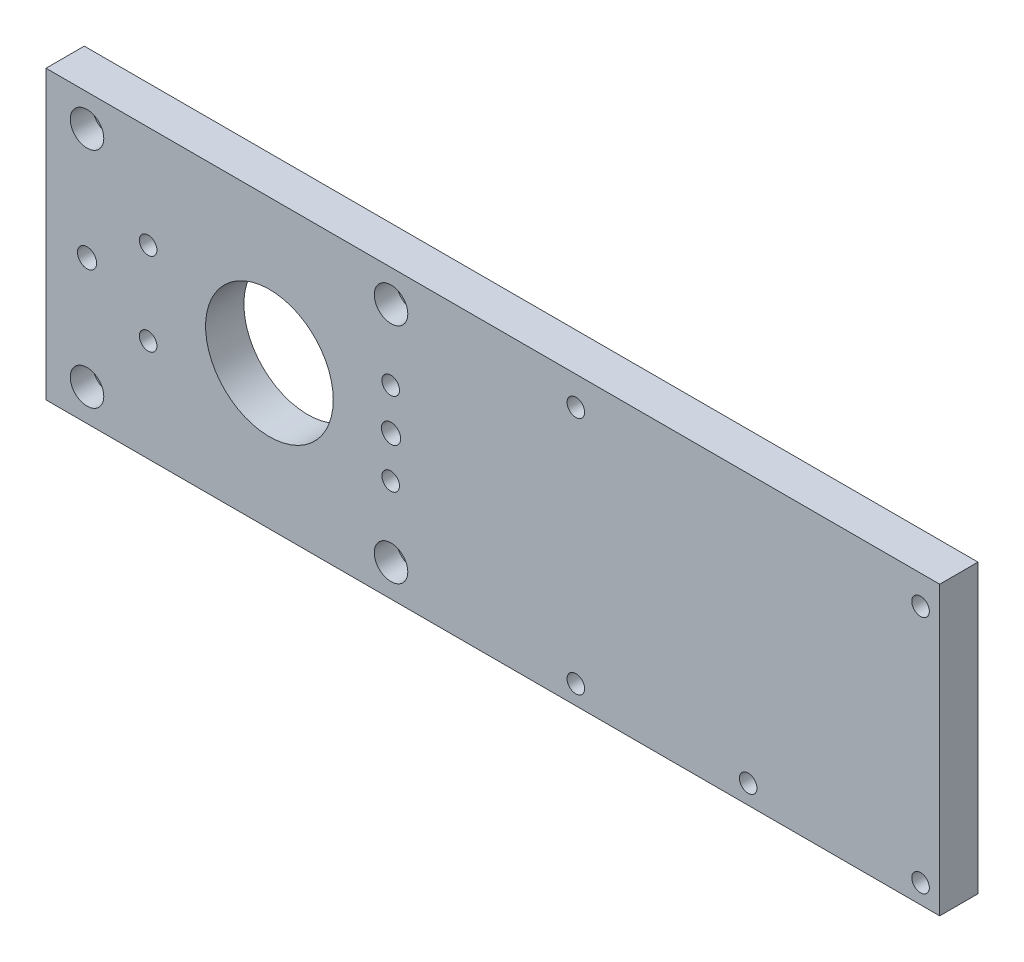
ISO-10303-21;
HEADER;
FILE_DESCRIPTION(('STEP AP214'),'2;1');
FILE_NAME('part.step','',(''),(''),'','','');
FILE_SCHEMA(('AUTOMOTIVE_DESIGN { 1 0 10303 214 1 1 1 1 }'));
ENDSEC;
DATA;
#1=APPLICATION_CONTEXT('core data for automotive mechanical design processes');
#2=APPLICATION_PROTOCOL_DEFINITION('international standard','automotive_design',2000,#1);
#3=PRODUCT_CONTEXT('',#1,'mechanical');
#4=PRODUCT('Part','Part','',(#3));
#5=PRODUCT_RELATED_PRODUCT_CATEGORY('part','',(#4));
#6=PRODUCT_DEFINITION_FORMATION('','',#4);
#7=PRODUCT_DEFINITION_CONTEXT('part definition',#1,'design');
#8=PRODUCT_DEFINITION('design','',#6,#7);
#9=PRODUCT_DEFINITION_SHAPE('','',#8);
#10=(LENGTH_UNIT() NAMED_UNIT(*) SI_UNIT(.MILLI.,.METRE.));
#11=(NAMED_UNIT(*) PLANE_ANGLE_UNIT() SI_UNIT($,.RADIAN.));
#12=(NAMED_UNIT(*) SI_UNIT($,.STERADIAN.) SOLID_ANGLE_UNIT());
#13=UNCERTAINTY_MEASURE_WITH_UNIT(LENGTH_MEASURE(1.E-05),#10,'distance_accuracy_value','');
#14=(GEOMETRIC_REPRESENTATION_CONTEXT(3) GLOBAL_UNCERTAINTY_ASSIGNED_CONTEXT((#13)) GLOBAL_UNIT_ASSIGNED_CONTEXT((#10,
#11,#12)) REPRESENTATION_CONTEXT('',''));
#15=CARTESIAN_POINT('',(0.,0.,0.));
#16=DIRECTION('',(0.,0.,1.));
#17=DIRECTION('',(1.,0.,0.));
#18=AXIS2_PLACEMENT_3D('',#15,#16,#17);
#19=CARTESIAN_POINT('',(134.,36.,-6.));
#20=DIRECTION('',(0.,0.,-1.));
#21=DIRECTION('',(-1.,0.,0.));
#22=AXIS2_PLACEMENT_3D('',#19,#20,#21);
#23=CYLINDRICAL_SURFACE('',#22,5.);
#24=CARTESIAN_POINT('',(134.,36.,-1.));
#25=DIRECTION('',(0.,0.,-1.));
#26=DIRECTION('',(-1.,0.,0.));
#27=AXIS2_PLACEMENT_3D('',#24,#25,#26);
#28=CIRCLE('',#27,5.);
#29=CARTESIAN_POINT('',(129.,36.,-1.));
#30=VERTEX_POINT('',#29);
#31=EDGE_CURVE('E207',#30,#30,#28,.T.);
#32=ORIENTED_EDGE('',*,*,#31,.F.);
#33=EDGE_LOOP('',(#32));
#34=FACE_BOUND('',#33,.T.);
#35=CARTESIAN_POINT('',(134.,36.,-6.));
#36=DIRECTION('',(0.,0.,-1.));
#37=DIRECTION('',(-1.,0.,0.));
#38=AXIS2_PLACEMENT_3D('',#35,#36,#37);
#39=CIRCLE('',#38,5.);
#40=CARTESIAN_POINT('',(129.,36.,-6.));
#41=VERTEX_POINT('',#40);
#42=EDGE_CURVE('E204',#41,#41,#39,.T.);
#43=ORIENTED_EDGE('',*,*,#42,.T.);
#44=EDGE_LOOP('',(#43));
#45=FACE_BOUND('',#44,.T.);
#46=ADVANCED_FACE('F17',(#34,#45),#23,.F.);
#47=CARTESIAN_POINT('',(134.,-39.,-6.));
#48=DIRECTION('',(0.,0.,-1.));
#49=DIRECTION('',(-1.,0.,0.));
#50=AXIS2_PLACEMENT_3D('',#47,#48,#49);
#51=CYLINDRICAL_SURFACE('',#50,5.);
#52=CARTESIAN_POINT('',(134.,-39.,-1.));
#53=DIRECTION('',(0.,0.,-1.));
#54=DIRECTION('',(-1.,0.,0.));
#55=AXIS2_PLACEMENT_3D('',#52,#53,#54);
#56=CIRCLE('',#55,5.);
#57=CARTESIAN_POINT('',(129.,-39.,-1.));
#58=VERTEX_POINT('',#57);
#59=EDGE_CURVE('E219',#58,#58,#56,.T.);
#60=ORIENTED_EDGE('',*,*,#59,.F.);
#61=EDGE_LOOP('',(#60));
#62=FACE_BOUND('',#61,.T.);
#63=CARTESIAN_POINT('',(134.,-39.,-6.));
#64=DIRECTION('',(0.,0.,-1.));
#65=DIRECTION('',(-1.,0.,0.));
#66=AXIS2_PLACEMENT_3D('',#63,#64,#65);
#67=CIRCLE('',#66,5.);
#68=CARTESIAN_POINT('',(129.,-39.,-6.));
#69=VERTEX_POINT('',#68);
#70=EDGE_CURVE('E201',#69,#69,#67,.T.);
#71=ORIENTED_EDGE('',*,*,#70,.T.);
#72=EDGE_LOOP('',(#71));
#73=FACE_BOUND('',#72,.T.);
#74=ADVANCED_FACE('F276',(#62,#73),#51,.F.);
#75=CARTESIAN_POINT('',(80.,-39.,-6.));
#76=DIRECTION('',(0.,0.,-1.));
#77=DIRECTION('',(-1.,0.,0.));
#78=AXIS2_PLACEMENT_3D('',#75,#76,#77);
#79=CYLINDRICAL_SURFACE('',#78,5.);
#80=CARTESIAN_POINT('',(80.,-39.,-1.));
#81=DIRECTION('',(0.,0.,-1.));
#82=DIRECTION('',(-1.,0.,0.));
#83=AXIS2_PLACEMENT_3D('',#80,#81,#82);
#84=CIRCLE('',#83,5.);
#85=CARTESIAN_POINT('',(75.,-39.,-1.));
#86=VERTEX_POINT('',#85);
#87=EDGE_CURVE('E216',#86,#86,#84,.T.);
#88=ORIENTED_EDGE('',*,*,#87,.F.);
#89=EDGE_LOOP('',(#88));
#90=FACE_BOUND('',#89,.T.);
#91=CARTESIAN_POINT('',(80.,-39.,-6.));
#92=DIRECTION('',(0.,0.,-1.));
#93=DIRECTION('',(-1.,0.,0.));
#94=AXIS2_PLACEMENT_3D('',#91,#92,#93);
#95=CIRCLE('',#94,5.);
#96=CARTESIAN_POINT('',(75.,-39.,-6.));
#97=VERTEX_POINT('',#96);
#98=EDGE_CURVE('E198',#97,#97,#95,.T.);
#99=ORIENTED_EDGE('',*,*,#98,.T.);
#100=EDGE_LOOP('',(#99));
#101=FACE_BOUND('',#100,.T.);
#102=ADVANCED_FACE('F282',(#90,#101),#79,.F.);
#103=CARTESIAN_POINT('',(26.,36.,-6.));
#104=DIRECTION('',(0.,0.,-1.));
#105=DIRECTION('',(-1.,0.,0.));
#106=AXIS2_PLACEMENT_3D('',#103,#104,#105);
#107=CYLINDRICAL_SURFACE('',#106,5.);
#108=CARTESIAN_POINT('',(26.,36.,-1.));
#109=DIRECTION('',(0.,0.,-1.));
#110=DIRECTION('',(-1.,0.,0.));
#111=AXIS2_PLACEMENT_3D('',#108,#109,#110);
#112=CIRCLE('',#111,5.);
#113=CARTESIAN_POINT('',(21.,36.,-1.));
#114=VERTEX_POINT('',#113);
#115=EDGE_CURVE('E210',#114,#114,#112,.T.);
#116=ORIENTED_EDGE('',*,*,#115,.F.);
#117=EDGE_LOOP('',(#116));
#118=FACE_BOUND('',#117,.T.);
#119=CARTESIAN_POINT('',(26.,36.,-6.));
#120=DIRECTION('',(0.,0.,-1.));
#121=DIRECTION('',(-1.,0.,0.));
#122=AXIS2_PLACEMENT_3D('',#119,#120,#121);
#123=CIRCLE('',#122,5.);
#124=CARTESIAN_POINT('',(21.,36.,-6.));
#125=VERTEX_POINT('',#124);
#126=EDGE_CURVE('E195',#125,#125,#123,.T.);
#127=ORIENTED_EDGE('',*,*,#126,.T.);
#128=EDGE_LOOP('',(#127));
#129=FACE_BOUND('',#128,.T.);
#130=ADVANCED_FACE('F415',(#118,#129),#107,.F.);
#131=CARTESIAN_POINT('',(26.,-39.,-6.));
#132=DIRECTION('',(0.,0.,-1.));
#133=DIRECTION('',(-1.,0.,0.));
#134=AXIS2_PLACEMENT_3D('',#131,#132,#133);
#135=CYLINDRICAL_SURFACE('',#134,5.);
#136=CARTESIAN_POINT('',(26.,-39.,-1.));
#137=DIRECTION('',(0.,0.,-1.));
#138=DIRECTION('',(-1.,0.,0.));
#139=AXIS2_PLACEMENT_3D('',#136,#137,#138);
#140=CIRCLE('',#139,5.);
#141=CARTESIAN_POINT('',(21.,-39.,-1.));
#142=VERTEX_POINT('',#141);
#143=EDGE_CURVE('E213',#142,#142,#140,.T.);
#144=ORIENTED_EDGE('',*,*,#143,.F.);
#145=EDGE_LOOP('',(#144));
#146=FACE_BOUND('',#145,.T.);
#147=CARTESIAN_POINT('',(26.,-39.,-6.));
#148=DIRECTION('',(0.,0.,-1.));
#149=DIRECTION('',(-1.,0.,0.));
#150=AXIS2_PLACEMENT_3D('',#147,#148,#149);
#151=CIRCLE('',#150,5.);
#152=CARTESIAN_POINT('',(21.,-39.,-6.));
#153=VERTEX_POINT('',#152);
#154=EDGE_CURVE('E192',#153,#153,#151,.T.);
#155=ORIENTED_EDGE('',*,*,#154,.T.);
#156=EDGE_LOOP('',(#155));
#157=FACE_BOUND('',#156,.T.);
#158=ADVANCED_FACE('F411',(#146,#157),#135,.F.);
#159=CARTESIAN_POINT('',(-127.15,-35.,-6.));
#160=DIRECTION('',(0.,0.,-1.));
#161=DIRECTION('',(-1.,0.,0.));
#162=AXIS2_PLACEMENT_3D('',#159,#160,#161);
#163=CYLINDRICAL_SURFACE('',#162,3.42500000000001);
#164=CARTESIAN_POINT('',(-127.15,-35.,-1.));
#165=DIRECTION('',(0.,0.,-1.));
#166=DIRECTION('',(-1.,0.,0.));
#167=AXIS2_PLACEMENT_3D('',#164,#165,#166);
#168=CIRCLE('',#167,3.42500000000001);
#169=CARTESIAN_POINT('',(-130.575,-35.,-1.));
#170=VERTEX_POINT('',#169);
#171=EDGE_CURVE('E227',#170,#170,#168,.T.);
#172=ORIENTED_EDGE('',*,*,#171,.F.);
#173=EDGE_LOOP('',(#172));
#174=FACE_BOUND('',#173,.T.);
#175=CARTESIAN_POINT('',(-127.15,-35.,-6.));
#176=DIRECTION('',(0.,0.,-1.));
#177=DIRECTION('',(-1.,0.,0.));
#178=AXIS2_PLACEMENT_3D('',#175,#176,#177);
#179=CIRCLE('',#178,3.42500000000001);
#180=CARTESIAN_POINT('',(-130.575,-35.,-6.));
#181=VERTEX_POINT('',#180);
#182=EDGE_CURVE('E189',#181,#181,#179,.T.);
#183=ORIENTED_EDGE('',*,*,#182,.T.);
#184=EDGE_LOOP('',(#183));
#185=FACE_BOUND('',#184,.T.);
#186=ADVANCED_FACE('F407',(#174,#185),#163,.F.);
#187=CARTESIAN_POINT('',(-31.9,-35.,-6.));
#188=DIRECTION('',(0.,0.,-1.));
#189=DIRECTION('',(-1.,0.,0.));
#190=AXIS2_PLACEMENT_3D('',#187,#188,#189);
#191=CYLINDRICAL_SURFACE('',#190,3.425);
#192=CARTESIAN_POINT('',(-31.9,-35.,-1.));
#193=DIRECTION('',(0.,0.,-1.));
#194=DIRECTION('',(-1.,0.,0.));
#195=AXIS2_PLACEMENT_3D('',#192,#193,#194);
#196=CIRCLE('',#195,3.425);
#197=CARTESIAN_POINT('',(-35.325,-35.,-1.));
#198=VERTEX_POINT('',#197);
#199=EDGE_CURVE('E222',#198,#198,#196,.T.);
#200=ORIENTED_EDGE('',*,*,#199,.F.);
#201=EDGE_LOOP('',(#200));
#202=FACE_BOUND('',#201,.T.);
#203=CARTESIAN_POINT('',(-31.9,-35.,-6.));
#204=DIRECTION('',(0.,0.,-1.));
#205=DIRECTION('',(-1.,0.,0.));
#206=AXIS2_PLACEMENT_3D('',#203,#204,#205);
#207=CIRCLE('',#206,3.425);
#208=CARTESIAN_POINT('',(-35.325,-35.,-6.));
#209=VERTEX_POINT('',#208);
#210=EDGE_CURVE('E186',#209,#209,#207,.T.);
#211=ORIENTED_EDGE('',*,*,#210,.T.);
#212=EDGE_LOOP('',(#211));
#213=FACE_BOUND('',#212,.T.);
#214=ADVANCED_FACE('F240',(#202,#213),#191,.F.);
#215=CARTESIAN_POINT('',(-127.15,35.,-6.));
#216=DIRECTION('',(0.,0.,-1.));
#217=DIRECTION('',(-1.,0.,0.));
#218=AXIS2_PLACEMENT_3D('',#215,#216,#217);
#219=CYLINDRICAL_SURFACE('',#218,3.42500000000001);
#220=CARTESIAN_POINT('',(-127.15,35.,-1.));
#221=DIRECTION('',(0.,0.,-1.));
#222=DIRECTION('',(-1.,0.,0.));
#223=AXIS2_PLACEMENT_3D('',#220,#221,#222);
#224=CIRCLE('',#223,3.42500000000001);
#225=CARTESIAN_POINT('',(-130.575,35.,-1.));
#226=VERTEX_POINT('',#225);
#227=EDGE_CURVE('E20',#226,#226,#224,.T.);
#228=ORIENTED_EDGE('',*,*,#227,.F.);
#229=EDGE_LOOP('',(#228));
#230=FACE_BOUND('',#229,.T.);
#231=CARTESIAN_POINT('',(-127.15,35.,-6.));
#232=DIRECTION('',(0.,0.,-1.));
#233=DIRECTION('',(-1.,0.,0.));
#234=AXIS2_PLACEMENT_3D('',#231,#232,#233);
#235=CIRCLE('',#234,3.42500000000001);
#236=CARTESIAN_POINT('',(-130.575,35.,-6.));
#237=VERTEX_POINT('',#236);
#238=EDGE_CURVE('E183',#237,#237,#235,.T.);
#239=ORIENTED_EDGE('',*,*,#238,.T.);
#240=EDGE_LOOP('',(#239));
#241=FACE_BOUND('',#240,.T.);
#242=ADVANCED_FACE('F236',(#230,#241),#219,.F.);
#243=CARTESIAN_POINT('',(-31.9,35.,-6.));
#244=DIRECTION('',(0.,0.,-1.));
#245=DIRECTION('',(-1.,0.,0.));
#246=AXIS2_PLACEMENT_3D('',#243,#244,#245);
#247=CYLINDRICAL_SURFACE('',#246,3.425);
#248=CARTESIAN_POINT('',(-31.9,35.,-1.));
#249=DIRECTION('',(0.,0.,-1.));
#250=DIRECTION('',(-1.,0.,0.));
#251=AXIS2_PLACEMENT_3D('',#248,#249,#250);
#252=CIRCLE('',#251,3.425);
#253=CARTESIAN_POINT('',(-35.325,35.,-1.));
#254=VERTEX_POINT('',#253);
#255=EDGE_CURVE('E225',#254,#254,#252,.T.);
#256=ORIENTED_EDGE('',*,*,#255,.F.);
#257=EDGE_LOOP('',(#256));
#258=FACE_BOUND('',#257,.T.);
#259=CARTESIAN_POINT('',(-31.9,35.,-6.));
#260=DIRECTION('',(0.,0.,-1.));
#261=DIRECTION('',(-1.,0.,0.));
#262=AXIS2_PLACEMENT_3D('',#259,#260,#261);
#263=CIRCLE('',#262,3.425);
#264=CARTESIAN_POINT('',(-35.325,35.,-6.));
#265=VERTEX_POINT('',#264);
#266=EDGE_CURVE('E180',#265,#265,#263,.T.);
#267=ORIENTED_EDGE('',*,*,#266,.T.);
#268=EDGE_LOOP('',(#267));
#269=FACE_BOUND('',#268,.T.);
#270=ADVANCED_FACE('F239',(#258,#269),#247,.F.);
#271=CARTESIAN_POINT('',(0.,0.,-1.));
#272=DIRECTION('',(0.,0.,1.));
#273=DIRECTION('',(1.,0.,0.));
#274=AXIS2_PLACEMENT_3D('',#271,#272,#273);
#275=PLANE('',#274);
#276=CARTESIAN_POINT('',(-127.15,35.,-1.));
#277=DIRECTION('',(0.,0.,1.));
#278=DIRECTION('',(1.,0.,0.));
#279=AXIS2_PLACEMENT_3D('',#276,#277,#278);
#280=CIRCLE('',#279,5.25);
#281=CARTESIAN_POINT('',(-121.9,35.,-1.));
#282=VERTEX_POINT('',#281);
#283=EDGE_CURVE('E177',#282,#282,#280,.T.);
#284=ORIENTED_EDGE('',*,*,#283,.T.);
#285=EDGE_LOOP('',(#284));
#286=FACE_BOUND('',#285,.T.);
#287=ORIENTED_EDGE('',*,*,#227,.T.);
#288=EDGE_LOOP('',(#287));
#289=FACE_BOUND('',#288,.T.);
#290=ADVANCED_FACE('F234',(#286,#289),#275,.T.);
#291=CARTESIAN_POINT('',(0.,0.,-1.));
#292=DIRECTION('',(0.,0.,1.));
#293=DIRECTION('',(1.,0.,0.));
#294=AXIS2_PLACEMENT_3D('',#291,#292,#293);
#295=PLANE('',#294);
#296=CARTESIAN_POINT('',(-127.15,-35.,-1.));
#297=DIRECTION('',(0.,0.,1.));
#298=DIRECTION('',(1.,0.,0.));
#299=AXIS2_PLACEMENT_3D('',#296,#297,#298);
#300=CIRCLE('',#299,5.25);
#301=CARTESIAN_POINT('',(-121.9,-35.,-1.));
#302=VERTEX_POINT('',#301);
#303=EDGE_CURVE('E174',#302,#302,#300,.T.);
#304=ORIENTED_EDGE('',*,*,#303,.T.);
#305=EDGE_LOOP('',(#304));
#306=FACE_BOUND('',#305,.T.);
#307=ORIENTED_EDGE('',*,*,#171,.T.);
#308=EDGE_LOOP('',(#307));
#309=FACE_BOUND('',#308,.T.);
#310=ADVANCED_FACE('F394',(#306,#309),#295,.T.);
#311=CARTESIAN_POINT('',(0.,0.,-1.));
#312=DIRECTION('',(0.,0.,1.));
#313=DIRECTION('',(1.,0.,0.));
#314=AXIS2_PLACEMENT_3D('',#311,#312,#313);
#315=PLANE('',#314);
#316=CARTESIAN_POINT('',(-31.9,35.,-1.));
#317=DIRECTION('',(0.,0.,1.));
#318=DIRECTION('',(1.,0.,0.));
#319=AXIS2_PLACEMENT_3D('',#316,#317,#318);
#320=CIRCLE('',#319,5.25);
#321=CARTESIAN_POINT('',(-26.65,35.,-1.));
#322=VERTEX_POINT('',#321);
#323=EDGE_CURVE('E171',#322,#322,#320,.T.);
#324=ORIENTED_EDGE('',*,*,#323,.T.);
#325=EDGE_LOOP('',(#324));
#326=FACE_BOUND('',#325,.T.);
#327=ORIENTED_EDGE('',*,*,#255,.T.);
#328=EDGE_LOOP('',(#327));
#329=FACE_BOUND('',#328,.T.);
#330=ADVANCED_FACE('F390',(#326,#329),#315,.T.);
#331=CARTESIAN_POINT('',(0.,0.,-1.));
#332=DIRECTION('',(0.,0.,1.));
#333=DIRECTION('',(1.,0.,0.));
#334=AXIS2_PLACEMENT_3D('',#331,#332,#333);
#335=PLANE('',#334);
#336=CARTESIAN_POINT('',(-31.9,-35.,-1.));
#337=DIRECTION('',(0.,0.,1.));
#338=DIRECTION('',(1.,0.,0.));
#339=AXIS2_PLACEMENT_3D('',#336,#337,#338);
#340=CIRCLE('',#339,5.25);
#341=CARTESIAN_POINT('',(-26.65,-35.,-1.));
#342=VERTEX_POINT('',#341);
#343=EDGE_CURVE('E168',#342,#342,#340,.T.);
#344=ORIENTED_EDGE('',*,*,#343,.T.);
#345=EDGE_LOOP('',(#344));
#346=FACE_BOUND('',#345,.T.);
#347=ORIENTED_EDGE('',*,*,#199,.T.);
#348=EDGE_LOOP('',(#347));
#349=FACE_BOUND('',#348,.T.);
#350=ADVANCED_FACE('F386',(#346,#349),#335,.T.);
#351=CARTESIAN_POINT('',(0.,0.,-1.));
#352=DIRECTION('',(0.,0.,-1.));
#353=DIRECTION('',(-1.,0.,0.));
#354=AXIS2_PLACEMENT_3D('',#351,#352,#353);
#355=PLANE('',#354);
#356=ORIENTED_EDGE('',*,*,#59,.T.);
#357=EDGE_LOOP('',(#356));
#358=FACE_BOUND('',#357,.T.);
#359=CARTESIAN_POINT('',(134.,-39.,-1.));
#360=DIRECTION('',(0.,0.,1.));
#361=DIRECTION('',(1.,0.,0.));
#362=AXIS2_PLACEMENT_3D('',#359,#360,#361);
#363=CIRCLE('',#362,2.75);
#364=CARTESIAN_POINT('',(136.75,-39.,-1.));
#365=VERTEX_POINT('',#364);
#366=EDGE_CURVE('E147',#365,#365,#363,.T.);
#367=ORIENTED_EDGE('',*,*,#366,.T.);
#368=EDGE_LOOP('',(#367));
#369=FACE_BOUND('',#368,.T.);
#370=ADVANCED_FACE('F382',(#358,#369),#355,.T.);
#371=CARTESIAN_POINT('',(0.,0.,-1.));
#372=DIRECTION('',(0.,0.,-1.));
#373=DIRECTION('',(-1.,0.,0.));
#374=AXIS2_PLACEMENT_3D('',#371,#372,#373);
#375=PLANE('',#374);
#376=ORIENTED_EDGE('',*,*,#87,.T.);
#377=EDGE_LOOP('',(#376));
#378=FACE_BOUND('',#377,.T.);
#379=CARTESIAN_POINT('',(80.,-39.,-1.));
#380=DIRECTION('',(0.,0.,1.));
#381=DIRECTION('',(1.,0.,0.));
#382=AXIS2_PLACEMENT_3D('',#379,#380,#381);
#383=CIRCLE('',#382,2.75);
#384=CARTESIAN_POINT('',(82.75,-39.,-1.));
#385=VERTEX_POINT('',#384);
#386=EDGE_CURVE('E144',#385,#385,#383,.T.);
#387=ORIENTED_EDGE('',*,*,#386,.T.);
#388=EDGE_LOOP('',(#387));
#389=FACE_BOUND('',#388,.T.);
#390=ADVANCED_FACE('F378',(#378,#389),#375,.T.);
#391=CARTESIAN_POINT('',(0.,0.,-1.));
#392=DIRECTION('',(0.,0.,-1.));
#393=DIRECTION('',(-1.,0.,0.));
#394=AXIS2_PLACEMENT_3D('',#391,#392,#393);
#395=PLANE('',#394);
#396=ORIENTED_EDGE('',*,*,#143,.T.);
#397=EDGE_LOOP('',(#396));
#398=FACE_BOUND('',#397,.T.);
#399=CARTESIAN_POINT('',(26.,-39.,-1.));
#400=DIRECTION('',(0.,0.,1.));
#401=DIRECTION('',(1.,0.,0.));
#402=AXIS2_PLACEMENT_3D('',#399,#400,#401);
#403=CIRCLE('',#402,2.75);
#404=CARTESIAN_POINT('',(28.75,-39.,-1.));
#405=VERTEX_POINT('',#404);
#406=EDGE_CURVE('E141',#405,#405,#403,.T.);
#407=ORIENTED_EDGE('',*,*,#406,.T.);
#408=EDGE_LOOP('',(#407));
#409=FACE_BOUND('',#408,.T.);
#410=ADVANCED_FACE('F374',(#398,#409),#395,.T.);
#411=CARTESIAN_POINT('',(0.,0.,-1.));
#412=DIRECTION('',(0.,0.,-1.));
#413=DIRECTION('',(-1.,0.,0.));
#414=AXIS2_PLACEMENT_3D('',#411,#412,#413);
#415=PLANE('',#414);
#416=ORIENTED_EDGE('',*,*,#115,.T.);
#417=EDGE_LOOP('',(#416));
#418=FACE_BOUND('',#417,.T.);
#419=CARTESIAN_POINT('',(26.,36.,-1.));
#420=DIRECTION('',(0.,0.,1.));
#421=DIRECTION('',(1.,0.,0.));
#422=AXIS2_PLACEMENT_3D('',#419,#420,#421);
#423=CIRCLE('',#422,2.75);
#424=CARTESIAN_POINT('',(28.75,36.,-1.));
#425=VERTEX_POINT('',#424);
#426=EDGE_CURVE('E138',#425,#425,#423,.T.);
#427=ORIENTED_EDGE('',*,*,#426,.T.);
#428=EDGE_LOOP('',(#427));
#429=FACE_BOUND('',#428,.T.);
#430=ADVANCED_FACE('F370',(#418,#429),#415,.T.);
#431=CARTESIAN_POINT('',(0.,0.,-1.));
#432=DIRECTION('',(0.,0.,-1.));
#433=DIRECTION('',(-1.,0.,0.));
#434=AXIS2_PLACEMENT_3D('',#431,#432,#433);
#435=PLANE('',#434);
#436=ORIENTED_EDGE('',*,*,#31,.T.);
#437=EDGE_LOOP('',(#436));
#438=FACE_BOUND('',#437,.T.);
#439=CARTESIAN_POINT('',(134.,36.,-1.));
#440=DIRECTION('',(0.,0.,1.));
#441=DIRECTION('',(1.,0.,0.));
#442=AXIS2_PLACEMENT_3D('',#439,#440,#441);
#443=CIRCLE('',#442,2.75);
#444=CARTESIAN_POINT('',(136.75,36.,-1.));
#445=VERTEX_POINT('',#444);
#446=EDGE_CURVE('E135',#445,#445,#443,.T.);
#447=ORIENTED_EDGE('',*,*,#446,.T.);
#448=EDGE_LOOP('',(#447));
#449=FACE_BOUND('',#448,.T.);
#450=ADVANCED_FACE('F247',(#438,#449),#435,.T.);
#451=CARTESIAN_POINT('',(0.,0.,-6.));
#452=DIRECTION('',(0.,0.,1.));
#453=DIRECTION('',(1.,0.,0.));
#454=AXIS2_PLACEMENT_3D('',#451,#452,#453);
#455=PLANE('',#454);
#456=DIRECTION('',(1.,0.,0.));
#457=VECTOR('',#456,1.);
#458=CARTESIAN_POINT('',(-140.,-45.,-6.));
#459=LINE('',#458,#457);
#460=CARTESIAN_POINT('',(-140.,-45.,-6.));
#461=VERTEX_POINT('',#460);
#462=CARTESIAN_POINT('',(140.,-45.,-6.));
#463=VERTEX_POINT('',#462);
#464=EDGE_CURVE('E73',#461,#463,#459,.T.);
#465=ORIENTED_EDGE('',*,*,#464,.F.);
#466=DIRECTION('',(0.,1.,0.));
#467=VECTOR('',#466,1.);
#468=CARTESIAN_POINT('',(-140.,45.,-6.));
#469=LINE('',#468,#467);
#470=CARTESIAN_POINT('',(-140.,45.,-6.));
#471=VERTEX_POINT('',#470);
#472=EDGE_CURVE('E55',#471,#461,#469,.F.);
#473=ORIENTED_EDGE('',*,*,#472,.F.);
#474=DIRECTION('',(1.,0.,0.));
#475=VECTOR('',#474,1.);
#476=CARTESIAN_POINT('',(140.,45.,-6.));
#477=LINE('',#476,#475);
#478=CARTESIAN_POINT('',(140.,45.,-6.));
#479=VERTEX_POINT('',#478);
#480=EDGE_CURVE('E60',#479,#471,#477,.F.);
#481=ORIENTED_EDGE('',*,*,#480,.F.);
#482=DIRECTION('',(0.,1.,0.));
#483=VECTOR('',#482,1.);
#484=CARTESIAN_POINT('',(140.,-45.,-6.));
#485=LINE('',#484,#483);
#486=EDGE_CURVE('E754',#463,#479,#485,.T.);
#487=ORIENTED_EDGE('',*,*,#486,.F.);
#488=EDGE_LOOP('',(#465,#473,#481,#487));
#489=FACE_BOUND('',#488,.T.);
#490=CARTESIAN_POINT('',(-70.,0.,-6.));
#491=DIRECTION('',(0.,0.,1.));
#492=DIRECTION('',(1.,0.,0.));
#493=AXIS2_PLACEMENT_3D('',#490,#491,#492);
#494=CIRCLE('',#493,20.);
#495=CARTESIAN_POINT('',(-50.,0.,-6.));
#496=VERTEX_POINT('',#495);
#497=EDGE_CURVE('E69',#496,#496,#494,.T.);
#498=ORIENTED_EDGE('',*,*,#497,.T.);
#499=EDGE_LOOP('',(#498));
#500=FACE_BOUND('',#499,.T.);
#501=ORIENTED_EDGE('',*,*,#266,.F.);
#502=EDGE_LOOP('',(#501));
#503=FACE_BOUND('',#502,.T.);
#504=ORIENTED_EDGE('',*,*,#238,.F.);
#505=EDGE_LOOP('',(#504));
#506=FACE_BOUND('',#505,.T.);
#507=ORIENTED_EDGE('',*,*,#210,.F.);
#508=EDGE_LOOP('',(#507));
#509=FACE_BOUND('',#508,.T.);
#510=ORIENTED_EDGE('',*,*,#182,.F.);
#511=EDGE_LOOP('',(#510));
#512=FACE_BOUND('',#511,.T.);
#513=CARTESIAN_POINT('',(-31.9,0.,-6.));
#514=DIRECTION('',(0.,0.,-1.));
#515=DIRECTION('',(-1.,0.,0.));
#516=AXIS2_PLACEMENT_3D('',#513,#514,#515);
#517=CIRCLE('',#516,3.);
#518=CARTESIAN_POINT('',(-34.9,0.,-6.));
#519=VERTEX_POINT('',#518);
#520=EDGE_CURVE('E150',#519,#519,#517,.F.);
#521=ORIENTED_EDGE('',*,*,#520,.T.);
#522=EDGE_LOOP('',(#521));
#523=FACE_BOUND('',#522,.T.);
#524=CARTESIAN_POINT('',(-127.15,0.,-6.));
#525=DIRECTION('',(0.,0.,-1.));
#526=DIRECTION('',(-1.,0.,0.));
#527=AXIS2_PLACEMENT_3D('',#524,#525,#526);
#528=CIRCLE('',#527,3.);
#529=CARTESIAN_POINT('',(-130.15,0.,-6.));
#530=VERTEX_POINT('',#529);
#531=EDGE_CURVE('E153',#530,#530,#528,.F.);
#532=ORIENTED_EDGE('',*,*,#531,.T.);
#533=EDGE_LOOP('',(#532));
#534=FACE_BOUND('',#533,.T.);
#535=CARTESIAN_POINT('',(-108.,13.,-6.));
#536=DIRECTION('',(0.,0.,-1.));
#537=DIRECTION('',(-1.,0.,0.));
#538=AXIS2_PLACEMENT_3D('',#535,#536,#537);
#539=CIRCLE('',#538,2.75);
#540=CARTESIAN_POINT('',(-110.75,13.,-6.));
#541=VERTEX_POINT('',#540);
#542=EDGE_CURVE('E156',#541,#541,#539,.F.);
#543=ORIENTED_EDGE('',*,*,#542,.T.);
#544=EDGE_LOOP('',(#543));
#545=FACE_BOUND('',#544,.T.);
#546=CARTESIAN_POINT('',(-108.,-13.,-6.));
#547=DIRECTION('',(0.,0.,-1.));
#548=DIRECTION('',(-1.,0.,0.));
#549=AXIS2_PLACEMENT_3D('',#546,#547,#548);
#550=CIRCLE('',#549,2.75);
#551=CARTESIAN_POINT('',(-110.75,-13.,-6.));
#552=VERTEX_POINT('',#551);
#553=EDGE_CURVE('E159',#552,#552,#550,.F.);
#554=ORIENTED_EDGE('',*,*,#553,.T.);
#555=EDGE_LOOP('',(#554));
#556=FACE_BOUND('',#555,.T.);
#557=CARTESIAN_POINT('',(-32.,13.,-6.));
#558=DIRECTION('',(0.,0.,-1.));
#559=DIRECTION('',(-1.,0.,0.));
#560=AXIS2_PLACEMENT_3D('',#557,#558,#559);
#561=CIRCLE('',#560,2.75);
#562=CARTESIAN_POINT('',(-34.75,13.,-6.));
#563=VERTEX_POINT('',#562);
#564=EDGE_CURVE('E162',#563,#563,#561,.F.);
#565=ORIENTED_EDGE('',*,*,#564,.T.);
#566=EDGE_LOOP('',(#565));
#567=FACE_BOUND('',#566,.T.);
#568=CARTESIAN_POINT('',(-32.,-13.,-6.));
#569=DIRECTION('',(0.,0.,-1.));
#570=DIRECTION('',(-1.,0.,0.));
#571=AXIS2_PLACEMENT_3D('',#568,#569,#570);
#572=CIRCLE('',#571,2.75);
#573=CARTESIAN_POINT('',(-34.75,-13.,-6.));
#574=VERTEX_POINT('',#573);
#575=EDGE_CURVE('E165',#574,#574,#572,.F.);
#576=ORIENTED_EDGE('',*,*,#575,.T.);
#577=EDGE_LOOP('',(#576));
#578=FACE_BOUND('',#577,.T.);
#579=ORIENTED_EDGE('',*,*,#154,.F.);
#580=EDGE_LOOP('',(#579));
#581=FACE_BOUND('',#580,.T.);
#582=ORIENTED_EDGE('',*,*,#126,.F.);
#583=EDGE_LOOP('',(#582));
#584=FACE_BOUND('',#583,.T.);
#585=ORIENTED_EDGE('',*,*,#98,.F.);
#586=EDGE_LOOP('',(#585));
#587=FACE_BOUND('',#586,.T.);
#588=ORIENTED_EDGE('',*,*,#70,.F.);
#589=EDGE_LOOP('',(#588));
#590=FACE_BOUND('',#589,.T.);
#591=ORIENTED_EDGE('',*,*,#42,.F.);
#592=EDGE_LOOP('',(#591));
#593=FACE_BOUND('',#592,.T.);
#594=ADVANCED_FACE('F71',(#489,#500,#503,#506,#509,#512,#523,#534,#545,#556,#567,#578,#581,#584,
#587,#590,#593),#455,.F.);
#595=CARTESIAN_POINT('',(-127.15,35.,6.));
#596=DIRECTION('',(0.,0.,1.));
#597=DIRECTION('',(1.,0.,0.));
#598=AXIS2_PLACEMENT_3D('',#595,#596,#597);
#599=CYLINDRICAL_SURFACE('',#598,5.25);
#600=ORIENTED_EDGE('',*,*,#283,.F.);
#601=EDGE_LOOP('',(#600));
#602=FACE_BOUND('',#601,.T.);
#603=CARTESIAN_POINT('',(-127.15,35.,6.));
#604=DIRECTION('',(0.,0.,1.));
#605=DIRECTION('',(1.,0.,0.));
#606=AXIS2_PLACEMENT_3D('',#603,#604,#605);
#607=CIRCLE('',#606,5.25);
#608=CARTESIAN_POINT('',(-121.9,35.,6.));
#609=VERTEX_POINT('',#608);
#610=EDGE_CURVE('E130',#609,#609,#607,.F.);
#611=ORIENTED_EDGE('',*,*,#610,.F.);
#612=EDGE_LOOP('',(#611));
#613=FACE_BOUND('',#612,.T.);
#614=ADVANCED_FACE('F246',(#602,#613),#599,.F.);
#615=CARTESIAN_POINT('',(-127.15,-35.,6.));
#616=DIRECTION('',(0.,0.,1.));
#617=DIRECTION('',(1.,0.,0.));
#618=AXIS2_PLACEMENT_3D('',#615,#616,#617);
#619=CYLINDRICAL_SURFACE('',#618,5.25);
#620=ORIENTED_EDGE('',*,*,#303,.F.);
#621=EDGE_LOOP('',(#620));
#622=FACE_BOUND('',#621,.T.);
#623=CARTESIAN_POINT('',(-127.15,-35.,6.));
#624=DIRECTION('',(0.,0.,1.));
#625=DIRECTION('',(1.,0.,0.));
#626=AXIS2_PLACEMENT_3D('',#623,#624,#625);
#627=CIRCLE('',#626,5.25);
#628=CARTESIAN_POINT('',(-121.9,-35.,6.));
#629=VERTEX_POINT('',#628);
#630=EDGE_CURVE('E127',#629,#629,#627,.F.);
#631=ORIENTED_EDGE('',*,*,#630,.F.);
#632=EDGE_LOOP('',(#631));
#633=FACE_BOUND('',#632,.T.);
#634=ADVANCED_FACE('F360',(#622,#633),#619,.F.);
#635=CARTESIAN_POINT('',(-31.9,35.,6.));
#636=DIRECTION('',(0.,0.,1.));
#637=DIRECTION('',(1.,0.,0.));
#638=AXIS2_PLACEMENT_3D('',#635,#636,#637);
#639=CYLINDRICAL_SURFACE('',#638,5.25);
#640=ORIENTED_EDGE('',*,*,#323,.F.);
#641=EDGE_LOOP('',(#640));
#642=FACE_BOUND('',#641,.T.);
#643=CARTESIAN_POINT('',(-31.9,35.,6.));
#644=DIRECTION('',(0.,0.,1.));
#645=DIRECTION('',(1.,0.,0.));
#646=AXIS2_PLACEMENT_3D('',#643,#644,#645);
#647=CIRCLE('',#646,5.25);
#648=CARTESIAN_POINT('',(-26.65,35.,6.));
#649=VERTEX_POINT('',#648);
#650=EDGE_CURVE('E124',#649,#649,#647,.F.);
#651=ORIENTED_EDGE('',*,*,#650,.F.);
#652=EDGE_LOOP('',(#651));
#653=FACE_BOUND('',#652,.T.);
#654=ADVANCED_FACE('F356',(#642,#653),#639,.F.);
#655=CARTESIAN_POINT('',(-31.9,-35.,6.));
#656=DIRECTION('',(0.,0.,1.));
#657=DIRECTION('',(1.,0.,0.));
#658=AXIS2_PLACEMENT_3D('',#655,#656,#657);
#659=CYLINDRICAL_SURFACE('',#658,5.25);
#660=ORIENTED_EDGE('',*,*,#343,.F.);
#661=EDGE_LOOP('',(#660));
#662=FACE_BOUND('',#661,.T.);
#663=CARTESIAN_POINT('',(-31.9,-35.,6.));
#664=DIRECTION('',(0.,0.,1.));
#665=DIRECTION('',(1.,0.,0.));
#666=AXIS2_PLACEMENT_3D('',#663,#664,#665);
#667=CIRCLE('',#666,5.25);
#668=CARTESIAN_POINT('',(-26.65,-35.,6.));
#669=VERTEX_POINT('',#668);
#670=EDGE_CURVE('E121',#669,#669,#667,.F.);
#671=ORIENTED_EDGE('',*,*,#670,.F.);
#672=EDGE_LOOP('',(#671));
#673=FACE_BOUND('',#672,.T.);
#674=ADVANCED_FACE('F352',(#662,#673),#659,.F.);
#675=CARTESIAN_POINT('',(-32.,-13.,13.05998503744));
#676=DIRECTION('',(0.,0.,-1.));
#677=DIRECTION('',(-1.,0.,0.));
#678=AXIS2_PLACEMENT_3D('',#675,#676,#677);
#679=CYLINDRICAL_SURFACE('',#678,2.75);
#680=ORIENTED_EDGE('',*,*,#575,.F.);
#681=EDGE_LOOP('',(#680));
#682=FACE_BOUND('',#681,.T.);
#683=CARTESIAN_POINT('',(-32.,-13.,6.));
#684=DIRECTION('',(0.,0.,-1.));
#685=DIRECTION('',(-1.,0.,0.));
#686=AXIS2_PLACEMENT_3D('',#683,#684,#685);
#687=CIRCLE('',#686,2.75);
#688=CARTESIAN_POINT('',(-34.75,-13.,6.));
#689=VERTEX_POINT('',#688);
#690=EDGE_CURVE('E118',#689,#689,#687,.T.);
#691=ORIENTED_EDGE('',*,*,#690,.F.);
#692=EDGE_LOOP('',(#691));
#693=FACE_BOUND('',#692,.T.);
#694=ADVANCED_FACE('F348',(#682,#693),#679,.F.);
#695=CARTESIAN_POINT('',(-32.,13.,13.05998503744));
#696=DIRECTION('',(0.,0.,-1.));
#697=DIRECTION('',(-1.,0.,0.));
#698=AXIS2_PLACEMENT_3D('',#695,#696,#697);
#699=CYLINDRICAL_SURFACE('',#698,2.75);
#700=ORIENTED_EDGE('',*,*,#564,.F.);
#701=EDGE_LOOP('',(#700));
#702=FACE_BOUND('',#701,.T.);
#703=CARTESIAN_POINT('',(-32.,13.,6.));
#704=DIRECTION('',(0.,0.,-1.));
#705=DIRECTION('',(-1.,0.,0.));
#706=AXIS2_PLACEMENT_3D('',#703,#704,#705);
#707=CIRCLE('',#706,2.75);
#708=CARTESIAN_POINT('',(-34.75,13.,6.));
#709=VERTEX_POINT('',#708);
#710=EDGE_CURVE('E115',#709,#709,#707,.T.);
#711=ORIENTED_EDGE('',*,*,#710,.F.);
#712=EDGE_LOOP('',(#711));
#713=FACE_BOUND('',#712,.T.);
#714=ADVANCED_FACE('F344',(#702,#713),#699,.F.);
#715=CARTESIAN_POINT('',(-108.,-13.,13.05998503744));
#716=DIRECTION('',(0.,0.,-1.));
#717=DIRECTION('',(-1.,0.,0.));
#718=AXIS2_PLACEMENT_3D('',#715,#716,#717);
#719=CYLINDRICAL_SURFACE('',#718,2.75);
#720=ORIENTED_EDGE('',*,*,#553,.F.);
#721=EDGE_LOOP('',(#720));
#722=FACE_BOUND('',#721,.T.);
#723=CARTESIAN_POINT('',(-108.,-13.,6.));
#724=DIRECTION('',(0.,0.,-1.));
#725=DIRECTION('',(-1.,0.,0.));
#726=AXIS2_PLACEMENT_3D('',#723,#724,#725);
#727=CIRCLE('',#726,2.75);
#728=CARTESIAN_POINT('',(-110.75,-13.,6.));
#729=VERTEX_POINT('',#728);
#730=EDGE_CURVE('E112',#729,#729,#727,.T.);
#731=ORIENTED_EDGE('',*,*,#730,.F.);
#732=EDGE_LOOP('',(#731));
#733=FACE_BOUND('',#732,.T.);
#734=ADVANCED_FACE('F340',(#722,#733),#719,.F.);
#735=CARTESIAN_POINT('',(-108.,13.,13.05998503744));
#736=DIRECTION('',(0.,0.,-1.));
#737=DIRECTION('',(-1.,0.,0.));
#738=AXIS2_PLACEMENT_3D('',#735,#736,#737);
#739=CYLINDRICAL_SURFACE('',#738,2.75);
#740=ORIENTED_EDGE('',*,*,#542,.F.);
#741=EDGE_LOOP('',(#740));
#742=FACE_BOUND('',#741,.T.);
#743=CARTESIAN_POINT('',(-108.,13.,6.));
#744=DIRECTION('',(0.,0.,-1.));
#745=DIRECTION('',(-1.,0.,0.));
#746=AXIS2_PLACEMENT_3D('',#743,#744,#745);
#747=CIRCLE('',#746,2.75);
#748=CARTESIAN_POINT('',(-110.75,13.,6.));
#749=VERTEX_POINT('',#748);
#750=EDGE_CURVE('E109',#749,#749,#747,.T.);
#751=ORIENTED_EDGE('',*,*,#750,.F.);
#752=EDGE_LOOP('',(#751));
#753=FACE_BOUND('',#752,.T.);
#754=ADVANCED_FACE('F336',(#742,#753),#739,.F.);
#755=CARTESIAN_POINT('',(-127.15,0.,-6.));
#756=DIRECTION('',(0.,0.,-1.));
#757=DIRECTION('',(-1.,0.,0.));
#758=AXIS2_PLACEMENT_3D('',#755,#756,#757);
#759=CYLINDRICAL_SURFACE('',#758,3.);
#760=ORIENTED_EDGE('',*,*,#531,.F.);
#761=EDGE_LOOP('',(#760));
#762=FACE_BOUND('',#761,.T.);
#763=CARTESIAN_POINT('',(-127.15,0.,6.));
#764=DIRECTION('',(0.,0.,-1.));
#765=DIRECTION('',(-1.,0.,0.));
#766=AXIS2_PLACEMENT_3D('',#763,#764,#765);
#767=CIRCLE('',#766,3.);
#768=CARTESIAN_POINT('',(-130.15,0.,6.));
#769=VERTEX_POINT('',#768);
#770=EDGE_CURVE('E106',#769,#769,#767,.T.);
#771=ORIENTED_EDGE('',*,*,#770,.F.);
#772=EDGE_LOOP('',(#771));
#773=FACE_BOUND('',#772,.T.);
#774=ADVANCED_FACE('F332',(#762,#773),#759,.F.);
#775=CARTESIAN_POINT('',(-31.9,0.,-6.));
#776=DIRECTION('',(0.,0.,-1.));
#777=DIRECTION('',(-1.,0.,0.));
#778=AXIS2_PLACEMENT_3D('',#775,#776,#777);
#779=CYLINDRICAL_SURFACE('',#778,3.);
#780=ORIENTED_EDGE('',*,*,#520,.F.);
#781=EDGE_LOOP('',(#780));
#782=FACE_BOUND('',#781,.T.);
#783=CARTESIAN_POINT('',(-31.9,0.,6.));
#784=DIRECTION('',(0.,0.,-1.));
#785=DIRECTION('',(-1.,0.,0.));
#786=AXIS2_PLACEMENT_3D('',#783,#784,#785);
#787=CIRCLE('',#786,3.);
#788=CARTESIAN_POINT('',(-34.9,0.,6.));
#789=VERTEX_POINT('',#788);
#790=EDGE_CURVE('E103',#789,#789,#787,.T.);
#791=ORIENTED_EDGE('',*,*,#790,.F.);
#792=EDGE_LOOP('',(#791));
#793=FACE_BOUND('',#792,.T.);
#794=ADVANCED_FACE('F328',(#782,#793),#779,.F.);
#795=CARTESIAN_POINT('',(134.,-39.,6.));
#796=DIRECTION('',(0.,0.,1.));
#797=DIRECTION('',(1.,0.,0.));
#798=AXIS2_PLACEMENT_3D('',#795,#796,#797);
#799=CYLINDRICAL_SURFACE('',#798,2.75);
#800=ORIENTED_EDGE('',*,*,#366,.F.);
#801=EDGE_LOOP('',(#800));
#802=FACE_BOUND('',#801,.T.);
#803=CARTESIAN_POINT('',(134.,-39.,6.));
#804=DIRECTION('',(0.,0.,1.));
#805=DIRECTION('',(1.,0.,0.));
#806=AXIS2_PLACEMENT_3D('',#803,#804,#805);
#807=CIRCLE('',#806,2.75);
#808=CARTESIAN_POINT('',(136.75,-39.,6.));
#809=VERTEX_POINT('',#808);
#810=EDGE_CURVE('E100',#809,#809,#807,.F.);
#811=ORIENTED_EDGE('',*,*,#810,.F.);
#812=EDGE_LOOP('',(#811));
#813=FACE_BOUND('',#812,.T.);
#814=ADVANCED_FACE('F324',(#802,#813),#799,.F.);
#815=CARTESIAN_POINT('',(80.,-39.,6.));
#816=DIRECTION('',(0.,0.,1.));
#817=DIRECTION('',(1.,0.,0.));
#818=AXIS2_PLACEMENT_3D('',#815,#816,#817);
#819=CYLINDRICAL_SURFACE('',#818,2.75);
#820=ORIENTED_EDGE('',*,*,#386,.F.);
#821=EDGE_LOOP('',(#820));
#822=FACE_BOUND('',#821,.T.);
#823=CARTESIAN_POINT('',(80.,-39.,6.));
#824=DIRECTION('',(0.,0.,1.));
#825=DIRECTION('',(1.,0.,0.));
#826=AXIS2_PLACEMENT_3D('',#823,#824,#825);
#827=CIRCLE('',#826,2.75);
#828=CARTESIAN_POINT('',(82.75,-39.,6.));
#829=VERTEX_POINT('',#828);
#830=EDGE_CURVE('E97',#829,#829,#827,.F.);
#831=ORIENTED_EDGE('',*,*,#830,.F.);
#832=EDGE_LOOP('',(#831));
#833=FACE_BOUND('',#832,.T.);
#834=ADVANCED_FACE('F320',(#822,#833),#819,.F.);
#835=CARTESIAN_POINT('',(26.,-39.,6.));
#836=DIRECTION('',(0.,0.,1.));
#837=DIRECTION('',(1.,0.,0.));
#838=AXIS2_PLACEMENT_3D('',#835,#836,#837);
#839=CYLINDRICAL_SURFACE('',#838,2.75);
#840=ORIENTED_EDGE('',*,*,#406,.F.);
#841=EDGE_LOOP('',(#840));
#842=FACE_BOUND('',#841,.T.);
#843=CARTESIAN_POINT('',(26.,-39.,6.));
#844=DIRECTION('',(0.,0.,1.));
#845=DIRECTION('',(1.,0.,0.));
#846=AXIS2_PLACEMENT_3D('',#843,#844,#845);
#847=CIRCLE('',#846,2.75);
#848=CARTESIAN_POINT('',(28.75,-39.,6.));
#849=VERTEX_POINT('',#848);
#850=EDGE_CURVE('E94',#849,#849,#847,.F.);
#851=ORIENTED_EDGE('',*,*,#850,.F.);
#852=EDGE_LOOP('',(#851));
#853=FACE_BOUND('',#852,.T.);
#854=ADVANCED_FACE('F316',(#842,#853),#839,.F.);
#855=CARTESIAN_POINT('',(26.,36.,6.));
#856=DIRECTION('',(0.,0.,1.));
#857=DIRECTION('',(1.,0.,0.));
#858=AXIS2_PLACEMENT_3D('',#855,#856,#857);
#859=CYLINDRICAL_SURFACE('',#858,2.75);
#860=ORIENTED_EDGE('',*,*,#426,.F.);
#861=EDGE_LOOP('',(#860));
#862=FACE_BOUND('',#861,.T.);
#863=CARTESIAN_POINT('',(26.,36.,6.));
#864=DIRECTION('',(0.,0.,1.));
#865=DIRECTION('',(1.,0.,0.));
#866=AXIS2_PLACEMENT_3D('',#863,#864,#865);
#867=CIRCLE('',#866,2.75);
#868=CARTESIAN_POINT('',(28.75,36.,6.));
#869=VERTEX_POINT('',#868);
#870=EDGE_CURVE('E91',#869,#869,#867,.F.);
#871=ORIENTED_EDGE('',*,*,#870,.F.);
#872=EDGE_LOOP('',(#871));
#873=FACE_BOUND('',#872,.T.);
#874=ADVANCED_FACE('F312',(#862,#873),#859,.F.);
#875=CARTESIAN_POINT('',(134.,36.,6.));
#876=DIRECTION('',(0.,0.,1.));
#877=DIRECTION('',(1.,0.,0.));
#878=AXIS2_PLACEMENT_3D('',#875,#876,#877);
#879=CYLINDRICAL_SURFACE('',#878,2.75);
#880=ORIENTED_EDGE('',*,*,#446,.F.);
#881=EDGE_LOOP('',(#880));
#882=FACE_BOUND('',#881,.T.);
#883=CARTESIAN_POINT('',(134.,36.,6.));
#884=DIRECTION('',(0.,0.,1.));
#885=DIRECTION('',(1.,0.,0.));
#886=AXIS2_PLACEMENT_3D('',#883,#884,#885);
#887=CIRCLE('',#886,2.75);
#888=CARTESIAN_POINT('',(136.75,36.,6.));
#889=VERTEX_POINT('',#888);
#890=EDGE_CURVE('E88',#889,#889,#887,.F.);
#891=ORIENTED_EDGE('',*,*,#890,.F.);
#892=EDGE_LOOP('',(#891));
#893=FACE_BOUND('',#892,.T.);
#894=ADVANCED_FACE('F308',(#882,#893),#879,.F.);
#895=CARTESIAN_POINT('',(-70.,0.,6.));
#896=DIRECTION('',(0.,0.,1.));
#897=DIRECTION('',(1.,0.,0.));
#898=AXIS2_PLACEMENT_3D('',#895,#896,#897);
#899=CYLINDRICAL_SURFACE('',#898,20.);
#900=ORIENTED_EDGE('',*,*,#497,.F.);
#901=EDGE_LOOP('',(#900));
#902=FACE_BOUND('',#901,.T.);
#903=CARTESIAN_POINT('',(-70.,0.,6.));
#904=DIRECTION('',(0.,0.,1.));
#905=DIRECTION('',(1.,0.,0.));
#906=AXIS2_PLACEMENT_3D('',#903,#904,#905);
#907=CIRCLE('',#906,20.);
#908=CARTESIAN_POINT('',(-50.,0.,6.));
#909=VERTEX_POINT('',#908);
#910=EDGE_CURVE('E84',#909,#909,#907,.F.);
#911=ORIENTED_EDGE('',*,*,#910,.F.);
#912=EDGE_LOOP('',(#911));
#913=FACE_BOUND('',#912,.T.);
#914=ADVANCED_FACE('F305',(#902,#913),#899,.F.);
#915=CARTESIAN_POINT('',(140.,45.,-6.));
#916=DIRECTION('',(0.,1.,0.));
#917=DIRECTION('',(0.,0.,1.));
#918=AXIS2_PLACEMENT_3D('',#915,#916,#917);
#919=PLANE('',#918);
#920=DIRECTION('',(0.,0.,1.));
#921=VECTOR('',#920,1.);
#922=CARTESIAN_POINT('',(-140.,45.,-6.));
#923=LINE('',#922,#921);
#924=CARTESIAN_POINT('',(-140.,45.,6.));
#925=VERTEX_POINT('',#924);
#926=EDGE_CURVE('E62',#925,#471,#923,.F.);
#927=ORIENTED_EDGE('',*,*,#926,.F.);
#928=DIRECTION('',(1.,0.,0.));
#929=VECTOR('',#928,1.);
#930=CARTESIAN_POINT('',(0.,45.,6.));
#931=LINE('',#930,#929);
#932=CARTESIAN_POINT('',(140.,45.,6.));
#933=VERTEX_POINT('',#932);
#934=EDGE_CURVE('E87',#933,#925,#931,.F.);
#935=ORIENTED_EDGE('',*,*,#934,.F.);
#936=DIRECTION('',(0.,0.,-1.));
#937=VECTOR('',#936,1.);
#938=CARTESIAN_POINT('',(140.,45.,-6.));
#939=LINE('',#938,#937);
#940=EDGE_CURVE('E65',#479,#933,#939,.F.);
#941=ORIENTED_EDGE('',*,*,#940,.F.);
#942=ORIENTED_EDGE('',*,*,#480,.T.);
#943=EDGE_LOOP('',(#927,#935,#941,#942));
#944=FACE_BOUND('',#943,.T.);
#945=ADVANCED_FACE('F61',(#944),#919,.T.);
#946=CARTESIAN_POINT('',(-140.,45.,-6.));
#947=DIRECTION('',(-1.,0.,0.));
#948=DIRECTION('',(0.,0.,1.));
#949=AXIS2_PLACEMENT_3D('',#946,#947,#948);
#950=PLANE('',#949);
#951=DIRECTION('',(0.,0.,-1.));
#952=VECTOR('',#951,1.);
#953=CARTESIAN_POINT('',(-140.,-45.,-6.));
#954=LINE('',#953,#952);
#955=CARTESIAN_POINT('',(-140.,-45.,6.));
#956=VERTEX_POINT('',#955);
#957=EDGE_CURVE('E75',#956,#461,#954,.T.);
#958=ORIENTED_EDGE('',*,*,#957,.F.);
#959=DIRECTION('',(0.,1.,0.));
#960=VECTOR('',#959,1.);
#961=CARTESIAN_POINT('',(-140.,0.,6.));
#962=LINE('',#961,#960);
#963=EDGE_CURVE('E79',#925,#956,#962,.F.);
#964=ORIENTED_EDGE('',*,*,#963,.F.);
#965=ORIENTED_EDGE('',*,*,#926,.T.);
#966=ORIENTED_EDGE('',*,*,#472,.T.);
#967=EDGE_LOOP('',(#958,#964,#965,#966));
#968=FACE_BOUND('',#967,.T.);
#969=ADVANCED_FACE('F77',(#968),#950,.T.);
#970=CARTESIAN_POINT('',(-140.,-45.,-6.));
#971=DIRECTION('',(0.,-1.,0.));
#972=DIRECTION('',(0.,0.,-1.));
#973=AXIS2_PLACEMENT_3D('',#970,#971,#972);
#974=PLANE('',#973);
#975=DIRECTION('',(0.,0.,-1.));
#976=VECTOR('',#975,1.);
#977=CARTESIAN_POINT('',(140.,-45.,-6.));
#978=LINE('',#977,#976);
#979=CARTESIAN_POINT('',(140.,-45.,6.));
#980=VERTEX_POINT('',#979);
#981=EDGE_CURVE('E35',#980,#463,#978,.T.);
#982=ORIENTED_EDGE('',*,*,#981,.F.);
#983=DIRECTION('',(1.,0.,0.));
#984=VECTOR('',#983,1.);
#985=CARTESIAN_POINT('',(0.,-45.,6.));
#986=LINE('',#985,#984);
#987=EDGE_CURVE('E26',#956,#980,#986,.T.);
#988=ORIENTED_EDGE('',*,*,#987,.F.);
#989=ORIENTED_EDGE('',*,*,#957,.T.);
#990=ORIENTED_EDGE('',*,*,#464,.T.);
#991=EDGE_LOOP('',(#982,#988,#989,#990));
#992=FACE_BOUND('',#991,.T.);
#993=ADVANCED_FACE('F293',(#992),#974,.T.);
#994=CARTESIAN_POINT('',(140.,-45.,-6.));
#995=DIRECTION('',(1.,0.,0.));
#996=DIRECTION('',(0.,0.,-1.));
#997=AXIS2_PLACEMENT_3D('',#994,#995,#996);
#998=PLANE('',#997);
#999=ORIENTED_EDGE('',*,*,#940,.T.);
#1000=DIRECTION('',(0.,1.,0.));
#1001=VECTOR('',#1000,1.);
#1002=CARTESIAN_POINT('',(140.,0.,6.));
#1003=LINE('',#1002,#1001);
#1004=EDGE_CURVE('E11',#980,#933,#1003,.T.);
#1005=ORIENTED_EDGE('',*,*,#1004,.F.);
#1006=ORIENTED_EDGE('',*,*,#981,.T.);
#1007=ORIENTED_EDGE('',*,*,#486,.T.);
#1008=EDGE_LOOP('',(#999,#1005,#1006,#1007));
#1009=FACE_BOUND('',#1008,.T.);
#1010=ADVANCED_FACE('F287',(#1009),#998,.T.);
#1011=CARTESIAN_POINT('',(0.,0.,6.));
#1012=DIRECTION('',(0.,0.,1.));
#1013=DIRECTION('',(1.,0.,0.));
#1014=AXIS2_PLACEMENT_3D('',#1011,#1012,#1013);
#1015=PLANE('',#1014);
#1016=ORIENTED_EDGE('',*,*,#987,.T.);
#1017=ORIENTED_EDGE('',*,*,#1004,.T.);
#1018=ORIENTED_EDGE('',*,*,#934,.T.);
#1019=ORIENTED_EDGE('',*,*,#963,.T.);
#1020=EDGE_LOOP('',(#1016,#1017,#1018,#1019));
#1021=FACE_BOUND('',#1020,.T.);
#1022=ORIENTED_EDGE('',*,*,#910,.T.);
#1023=EDGE_LOOP('',(#1022));
#1024=FACE_BOUND('',#1023,.T.);
#1025=ORIENTED_EDGE('',*,*,#890,.T.);
#1026=EDGE_LOOP('',(#1025));
#1027=FACE_BOUND('',#1026,.T.);
#1028=ORIENTED_EDGE('',*,*,#870,.T.);
#1029=EDGE_LOOP('',(#1028));
#1030=FACE_BOUND('',#1029,.T.);
#1031=ORIENTED_EDGE('',*,*,#850,.T.);
#1032=EDGE_LOOP('',(#1031));
#1033=FACE_BOUND('',#1032,.T.);
#1034=ORIENTED_EDGE('',*,*,#830,.T.);
#1035=EDGE_LOOP('',(#1034));
#1036=FACE_BOUND('',#1035,.T.);
#1037=ORIENTED_EDGE('',*,*,#810,.T.);
#1038=EDGE_LOOP('',(#1037));
#1039=FACE_BOUND('',#1038,.T.);
#1040=ORIENTED_EDGE('',*,*,#790,.T.);
#1041=EDGE_LOOP('',(#1040));
#1042=FACE_BOUND('',#1041,.T.);
#1043=ORIENTED_EDGE('',*,*,#770,.T.);
#1044=EDGE_LOOP('',(#1043));
#1045=FACE_BOUND('',#1044,.T.);
#1046=ORIENTED_EDGE('',*,*,#750,.T.);
#1047=EDGE_LOOP('',(#1046));
#1048=FACE_BOUND('',#1047,.T.);
#1049=ORIENTED_EDGE('',*,*,#730,.T.);
#1050=EDGE_LOOP('',(#1049));
#1051=FACE_BOUND('',#1050,.T.);
#1052=ORIENTED_EDGE('',*,*,#710,.T.);
#1053=EDGE_LOOP('',(#1052));
#1054=FACE_BOUND('',#1053,.T.);
#1055=ORIENTED_EDGE('',*,*,#690,.T.);
#1056=EDGE_LOOP('',(#1055));
#1057=FACE_BOUND('',#1056,.T.);
#1058=ORIENTED_EDGE('',*,*,#670,.T.);
#1059=EDGE_LOOP('',(#1058));
#1060=FACE_BOUND('',#1059,.T.);
#1061=ORIENTED_EDGE('',*,*,#650,.T.);
#1062=EDGE_LOOP('',(#1061));
#1063=FACE_BOUND('',#1062,.T.);
#1064=ORIENTED_EDGE('',*,*,#630,.T.);
#1065=EDGE_LOOP('',(#1064));
#1066=FACE_BOUND('',#1065,.T.);
#1067=ORIENTED_EDGE('',*,*,#610,.T.);
#1068=EDGE_LOOP('',(#1067));
#1069=FACE_BOUND('',#1068,.T.);
#1070=ADVANCED_FACE('F285',(#1021,#1024,#1027,#1030,#1033,#1036,#1039,#1042,#1045,#1048,#1051,
#1054,#1057,#1060,#1063,#1066,#1069),#1015,.T.);
#1071=CLOSED_SHELL('',(#46,#74,#102,#130,#158,#186,#214,#242,#270,#290,#310,#330,#350,#370,#390,
#410,#430,#450,#594,#614,#634,#654,#674,#694,#714,#734,#754,#774,#794,#814,#834,#854,#874,#894,
#914,#945,#969,#993,#1010,#1070));
#1072=MANIFOLD_SOLID_BREP('B1',#1071);
#1073=ADVANCED_BREP_SHAPE_REPRESENTATION('',(#18,#1072),#14);
#1074=SHAPE_DEFINITION_REPRESENTATION(#9,#1073);
ENDSEC;
END-ISO-10303-21;
